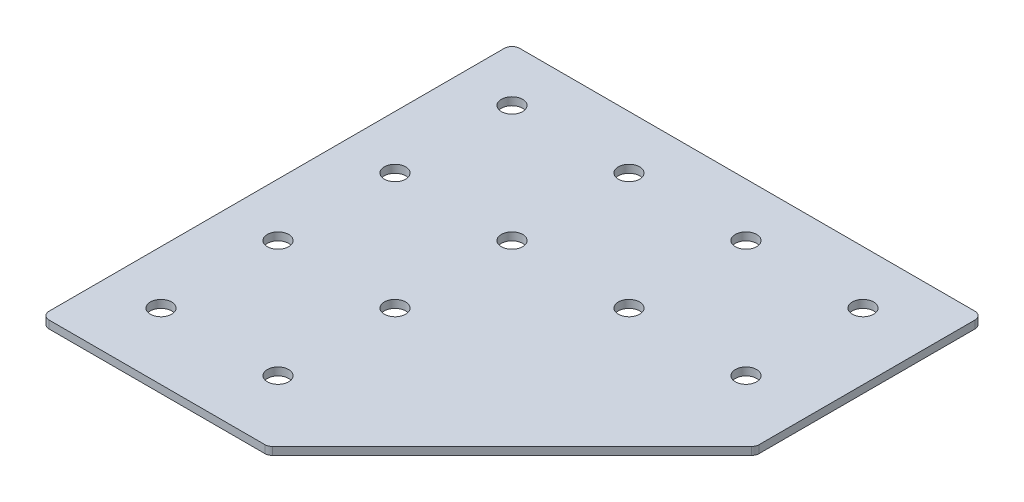
ISO-10303-21;
HEADER;
FILE_DESCRIPTION(('STEP AP214'),'2;1');
FILE_NAME('part.step','',(''),(''),'','','');
FILE_SCHEMA(('AUTOMOTIVE_DESIGN { 1 0 10303 214 1 1 1 1 }'));
ENDSEC;
DATA;
#1=APPLICATION_CONTEXT('core data for automotive mechanical design processes');
#2=APPLICATION_PROTOCOL_DEFINITION('international standard','automotive_design',2000,#1);
#3=PRODUCT_CONTEXT('',#1,'mechanical');
#4=PRODUCT('Part','Part','',(#3));
#5=PRODUCT_RELATED_PRODUCT_CATEGORY('part','',(#4));
#6=PRODUCT_DEFINITION_FORMATION('','',#4);
#7=PRODUCT_DEFINITION_CONTEXT('part definition',#1,'design');
#8=PRODUCT_DEFINITION('design','',#6,#7);
#9=PRODUCT_DEFINITION_SHAPE('','',#8);
#10=(LENGTH_UNIT() NAMED_UNIT(*) SI_UNIT(.MILLI.,.METRE.));
#11=(NAMED_UNIT(*) PLANE_ANGLE_UNIT() SI_UNIT($,.RADIAN.));
#12=(NAMED_UNIT(*) SI_UNIT($,.STERADIAN.) SOLID_ANGLE_UNIT());
#13=UNCERTAINTY_MEASURE_WITH_UNIT(LENGTH_MEASURE(1.E-05),#10,'distance_accuracy_value','');
#14=(GEOMETRIC_REPRESENTATION_CONTEXT(3) GLOBAL_UNCERTAINTY_ASSIGNED_CONTEXT((#13)) GLOBAL_UNIT_ASSIGNED_CONTEXT((#10,
#11,#12)) REPRESENTATION_CONTEXT('',''));
#15=CARTESIAN_POINT('',(0.,0.,0.));
#16=DIRECTION('',(0.,0.,1.));
#17=DIRECTION('',(1.,0.,0.));
#18=AXIS2_PLACEMENT_3D('',#15,#16,#17);
#19=CARTESIAN_POINT('',(-49.3577211963019,1.64126526069458,-48.7830335623448));
#20=DIRECTION('',(0.,-1.,0.));
#21=DIRECTION('',(0.,0.,-1.));
#22=AXIS2_PLACEMENT_3D('',#19,#20,#21);
#23=PLANE('',#22);
#24=CARTESIAN_POINT('',(63.1422788036981,1.64126526069458,-26.2830335623448));
#25=DIRECTION('',(0.,1.,0.));
#26=DIRECTION('',(0.,0.,1.));
#27=AXIS2_PLACEMENT_3D('',#24,#25,#26);
#28=CIRCLE('',#27,4.1);
#29=CARTESIAN_POINT('',(63.1422788036981,1.64126526069458,-22.1830335623448));
#30=VERTEX_POINT('',#29);
#31=EDGE_CURVE('E275',#30,#30,#28,.T.);
#32=ORIENTED_EDGE('',*,*,#31,.T.);
#33=EDGE_LOOP('',(#32));
#34=FACE_BOUND('',#33,.T.);
#35=CARTESIAN_POINT('',(18.1422788036981,1.64126526069458,-26.2830335623448));
#36=DIRECTION('',(0.,1.,0.));
#37=DIRECTION('',(0.,0.,1.));
#38=AXIS2_PLACEMENT_3D('',#35,#36,#37);
#39=CIRCLE('',#38,4.09999999999999);
#40=CARTESIAN_POINT('',(18.1422788036981,1.64126526069458,-22.1830335623448));
#41=VERTEX_POINT('',#40);
#42=EDGE_CURVE('E283',#41,#41,#39,.T.);
#43=ORIENTED_EDGE('',*,*,#42,.T.);
#44=EDGE_LOOP('',(#43));
#45=FACE_BOUND('',#44,.T.);
#46=CARTESIAN_POINT('',(-26.8577211963019,1.64126526069458,63.7169664376552));
#47=DIRECTION('',(0.,1.,0.));
#48=DIRECTION('',(0.,0.,1.));
#49=AXIS2_PLACEMENT_3D('',#46,#47,#48);
#50=CIRCLE('',#49,4.1);
#51=CARTESIAN_POINT('',(-26.8577211963019,1.64126526069458,67.8169664376552));
#52=VERTEX_POINT('',#51);
#53=EDGE_CURVE('E289',#52,#52,#50,.T.);
#54=ORIENTED_EDGE('',*,*,#53,.T.);
#55=EDGE_LOOP('',(#54));
#56=FACE_BOUND('',#55,.T.);
#57=CARTESIAN_POINT('',(-71.8577211963019,1.64126526069458,63.7169664376552));
#58=DIRECTION('',(0.,1.,0.));
#59=DIRECTION('',(0.,0.,1.));
#60=AXIS2_PLACEMENT_3D('',#57,#58,#59);
#61=CIRCLE('',#60,4.1);
#62=CARTESIAN_POINT('',(-71.8577211963019,1.64126526069458,67.8169664376552));
#63=VERTEX_POINT('',#62);
#64=EDGE_CURVE('E295',#63,#63,#61,.T.);
#65=ORIENTED_EDGE('',*,*,#64,.T.);
#66=EDGE_LOOP('',(#65));
#67=FACE_BOUND('',#66,.T.);
#68=CARTESIAN_POINT('',(-26.8577211963019,1.64126526069458,18.7169664376552));
#69=DIRECTION('',(0.,1.,0.));
#70=DIRECTION('',(0.,0.,1.));
#71=AXIS2_PLACEMENT_3D('',#68,#69,#70);
#72=CIRCLE('',#71,4.1);
#73=CARTESIAN_POINT('',(-26.8577211963019,1.64126526069458,22.8169664376552));
#74=VERTEX_POINT('',#73);
#75=EDGE_CURVE('E301',#74,#74,#72,.T.);
#76=ORIENTED_EDGE('',*,*,#75,.T.);
#77=EDGE_LOOP('',(#76));
#78=FACE_BOUND('',#77,.T.);
#79=CARTESIAN_POINT('',(-71.857721196302,1.64126526069458,18.7169664376552));
#80=DIRECTION('',(0.,1.,0.));
#81=DIRECTION('',(0.,0.,1.));
#82=AXIS2_PLACEMENT_3D('',#79,#80,#81);
#83=CIRCLE('',#82,4.1);
#84=CARTESIAN_POINT('',(-71.857721196302,1.64126526069458,22.8169664376552));
#85=VERTEX_POINT('',#84);
#86=EDGE_CURVE('E307',#85,#85,#83,.T.);
#87=ORIENTED_EDGE('',*,*,#86,.T.);
#88=EDGE_LOOP('',(#87));
#89=FACE_BOUND('',#88,.T.);
#90=CARTESIAN_POINT('',(-26.8577211963019,1.64126526069458,-26.2830335623448));
#91=DIRECTION('',(0.,1.,0.));
#92=DIRECTION('',(0.,0.,1.));
#93=AXIS2_PLACEMENT_3D('',#90,#91,#92);
#94=CIRCLE('',#93,4.1);
#95=CARTESIAN_POINT('',(-26.8577211963019,1.64126526069458,-22.1830335623448));
#96=VERTEX_POINT('',#95);
#97=EDGE_CURVE('E313',#96,#96,#94,.T.);
#98=ORIENTED_EDGE('',*,*,#97,.T.);
#99=EDGE_LOOP('',(#98));
#100=FACE_BOUND('',#99,.T.);
#101=CARTESIAN_POINT('',(-71.857721196302,1.64126526069458,-26.2830335623448));
#102=DIRECTION('',(0.,1.,0.));
#103=DIRECTION('',(0.,0.,1.));
#104=AXIS2_PLACEMENT_3D('',#101,#102,#103);
#105=CIRCLE('',#104,4.1);
#106=CARTESIAN_POINT('',(-71.857721196302,1.64126526069458,-22.1830335623448));
#107=VERTEX_POINT('',#106);
#108=EDGE_CURVE('E319',#107,#107,#105,.T.);
#109=ORIENTED_EDGE('',*,*,#108,.T.);
#110=EDGE_LOOP('',(#109));
#111=FACE_BOUND('',#110,.T.);
#112=CARTESIAN_POINT('',(63.1422788036981,1.64126526069458,-71.2830335623448));
#113=DIRECTION('',(0.,1.,0.));
#114=DIRECTION('',(0.,0.,1.));
#115=AXIS2_PLACEMENT_3D('',#112,#113,#114);
#116=CIRCLE('',#115,4.09999999999999);
#117=CARTESIAN_POINT('',(63.1422788036981,1.64126526069458,-67.1830335623448));
#118=VERTEX_POINT('',#117);
#119=EDGE_CURVE('E325',#118,#118,#116,.T.);
#120=ORIENTED_EDGE('',*,*,#119,.T.);
#121=EDGE_LOOP('',(#120));
#122=FACE_BOUND('',#121,.T.);
#123=CARTESIAN_POINT('',(18.1422788036981,1.64126526069458,-71.2830335623448));
#124=DIRECTION('',(0.,1.,0.));
#125=DIRECTION('',(0.,0.,1.));
#126=AXIS2_PLACEMENT_3D('',#123,#124,#125);
#127=CIRCLE('',#126,4.09999999999999);
#128=CARTESIAN_POINT('',(18.1422788036981,1.64126526069458,-67.1830335623448));
#129=VERTEX_POINT('',#128);
#130=EDGE_CURVE('E331',#129,#129,#127,.T.);
#131=ORIENTED_EDGE('',*,*,#130,.T.);
#132=EDGE_LOOP('',(#131));
#133=FACE_BOUND('',#132,.T.);
#134=CARTESIAN_POINT('',(-26.8577211963019,1.64126526069458,-71.2830335623448));
#135=DIRECTION('',(0.,1.,0.));
#136=DIRECTION('',(0.,0.,1.));
#137=AXIS2_PLACEMENT_3D('',#134,#135,#136);
#138=CIRCLE('',#137,4.1);
#139=CARTESIAN_POINT('',(-26.8577211963019,1.64126526069458,-67.1830335623448));
#140=VERTEX_POINT('',#139);
#141=EDGE_CURVE('E337',#140,#140,#138,.T.);
#142=ORIENTED_EDGE('',*,*,#141,.T.);
#143=EDGE_LOOP('',(#142));
#144=FACE_BOUND('',#143,.T.);
#145=CARTESIAN_POINT('',(-71.857721196302,1.64126526069458,-71.2830335623448));
#146=DIRECTION('',(0.,1.,0.));
#147=DIRECTION('',(0.,0.,1.));
#148=AXIS2_PLACEMENT_3D('',#145,#146,#147);
#149=CIRCLE('',#148,4.1);
#150=CARTESIAN_POINT('',(-71.857721196302,1.64126526069458,-67.1830335623448));
#151=VERTEX_POINT('',#150);
#152=EDGE_CURVE('E175',#151,#151,#149,.T.);
#153=ORIENTED_EDGE('',*,*,#152,.T.);
#154=EDGE_LOOP('',(#153));
#155=FACE_BOUND('',#154,.T.);
#156=DIRECTION('',(1.,0.,0.));
#157=VECTOR('',#156,1.);
#158=CARTESIAN_POINT('',(-92.357721196302,1.64126526069458,89.2169664376552));
#159=LINE('',#158,#157);
#160=CARTESIAN_POINT('',(-89.357721196302,1.64126526069458,89.2169664376552));
#161=VERTEX_POINT('',#160);
#162=CARTESIAN_POINT('',(-6.42878900816728,1.64126526069458,89.2169664376552));
#163=VERTEX_POINT('',#162);
#164=EDGE_CURVE('E121',#161,#163,#159,.T.);
#165=ORIENTED_EDGE('',*,*,#164,.F.);
#166=CARTESIAN_POINT('',(-89.357721196302,1.64126526069458,86.2169664376552));
#167=DIRECTION('',(0.,-1.,0.));
#168=DIRECTION('',(0.,0.,-1.));
#169=AXIS2_PLACEMENT_3D('',#166,#167,#168);
#170=CIRCLE('',#169,3.);
#171=CARTESIAN_POINT('',(-92.357721196302,1.64126526069458,86.2169664376552));
#172=VERTEX_POINT('',#171);
#173=EDGE_CURVE('E145',#161,#172,#170,.T.);
#174=ORIENTED_EDGE('',*,*,#173,.T.);
#175=DIRECTION('',(0.,0.,1.));
#176=VECTOR('',#175,1.);
#177=CARTESIAN_POINT('',(-92.357721196302,1.64126526069458,-91.7830335623448));
#178=LINE('',#177,#176);
#179=CARTESIAN_POINT('',(-92.357721196302,1.64126526069458,-88.7830335623448));
#180=VERTEX_POINT('',#179);
#181=EDGE_CURVE('E162',#180,#172,#178,.T.);
#182=ORIENTED_EDGE('',*,*,#181,.F.);
#183=CARTESIAN_POINT('',(-89.357721196302,1.64126526069458,-88.7830335623448));
#184=DIRECTION('',(0.,-1.,0.));
#185=DIRECTION('',(0.,0.,-1.));
#186=AXIS2_PLACEMENT_3D('',#183,#184,#185);
#187=CIRCLE('',#186,3.);
#188=CARTESIAN_POINT('',(-89.357721196302,1.64126526069458,-91.7830335623448));
#189=VERTEX_POINT('',#188);
#190=EDGE_CURVE('E117',#180,#189,#187,.T.);
#191=ORIENTED_EDGE('',*,*,#190,.T.);
#192=DIRECTION('',(-1.,0.,0.));
#193=VECTOR('',#192,1.);
#194=CARTESIAN_POINT('',(88.642278803698,1.64126526069458,-91.7830335623448));
#195=LINE('',#194,#193);
#196=CARTESIAN_POINT('',(85.642278803698,1.64126526069458,-91.7830335623448));
#197=VERTEX_POINT('',#196);
#198=EDGE_CURVE('E160',#197,#189,#195,.T.);
#199=ORIENTED_EDGE('',*,*,#198,.F.);
#200=CARTESIAN_POINT('',(85.642278803698,1.64126526069458,-88.7830335623448));
#201=DIRECTION('',(0.,-1.,0.));
#202=DIRECTION('',(0.,0.,-1.));
#203=AXIS2_PLACEMENT_3D('',#200,#201,#202);
#204=CIRCLE('',#203,3.);
#205=CARTESIAN_POINT('',(88.642278803698,1.64126526069458,-88.7830335623448));
#206=VERTEX_POINT('',#205);
#207=EDGE_CURVE('E140',#197,#206,#204,.T.);
#208=ORIENTED_EDGE('',*,*,#207,.T.);
#209=DIRECTION('',(0.,0.,-1.));
#210=VECTOR('',#209,1.);
#211=CARTESIAN_POINT('',(88.642278803698,1.64126526069458,-4.6114606870909));
#212=LINE('',#211,#210);
#213=CARTESIAN_POINT('',(88.642278803698,1.64126526069458,-5.85410137421019));
#214=VERTEX_POINT('',#213);
#215=EDGE_CURVE('E163',#214,#206,#212,.T.);
#216=ORIENTED_EDGE('',*,*,#215,.F.);
#217=CARTESIAN_POINT('',(85.642278803698,1.64126526069458,-5.85410137421019));
#218=DIRECTION('',(0.,-1.,0.));
#219=DIRECTION('',(0.,0.,-1.));
#220=AXIS2_PLACEMENT_3D('',#217,#218,#219);
#221=CIRCLE('',#220,3.);
#222=CARTESIAN_POINT('',(87.7635991472576,1.64126526069458,-3.73278103065054));
#223=VERTEX_POINT('',#222);
#224=EDGE_CURVE('E31',#214,#223,#221,.T.);
#225=ORIENTED_EDGE('',*,*,#224,.T.);
#226=DIRECTION('',(0.707106781186547,0.,-0.707106781186548));
#227=VECTOR('',#226,1.);
#228=CARTESIAN_POINT('',(-5.18614832104801,1.64126526069458,89.2169664376552));
#229=LINE('',#228,#227);
#230=CARTESIAN_POINT('',(-4.30746866460764,1.64126526069458,88.3382867812148));
#231=VERTEX_POINT('',#230);
#232=EDGE_CURVE('E118',#231,#223,#229,.T.);
#233=ORIENTED_EDGE('',*,*,#232,.F.);
#234=CARTESIAN_POINT('',(-6.42878900816728,1.64126526069458,86.2169664376552));
#235=DIRECTION('',(0.,-1.,0.));
#236=DIRECTION('',(0.,0.,-1.));
#237=AXIS2_PLACEMENT_3D('',#234,#235,#236);
#238=CIRCLE('',#237,3.);
#239=EDGE_CURVE('E143',#231,#163,#238,.T.);
#240=ORIENTED_EDGE('',*,*,#239,.T.);
#241=EDGE_LOOP('',(#165,#174,#182,#191,#199,#208,#216,#225,#233,#240));
#242=FACE_BOUND('',#241,.T.);
#243=ADVANCED_FACE('F16',(#34,#45,#56,#67,#78,#89,#100,#111,#122,#133,#144,#155,#242),#23,.T.);
#244=CARTESIAN_POINT('',(88.642278803698,1.64126526069458,-4.6114606870909));
#245=DIRECTION('',(1.,0.,0.));
#246=DIRECTION('',(0.,0.,-1.));
#247=AXIS2_PLACEMENT_3D('',#244,#245,#246);
#248=PLANE('',#247);
#249=DIRECTION('',(0.,0.,-1.));
#250=VECTOR('',#249,1.);
#251=CARTESIAN_POINT('',(88.642278803698,4.64126526069458,-4.6114606870909));
#252=LINE('',#251,#250);
#253=CARTESIAN_POINT('',(88.642278803698,4.64126526069458,-5.85410137421019));
#254=VERTEX_POINT('',#253);
#255=CARTESIAN_POINT('',(88.642278803698,4.64126526069458,-88.7830335623448));
#256=VERTEX_POINT('',#255);
#257=EDGE_CURVE('E172',#254,#256,#252,.T.);
#258=ORIENTED_EDGE('',*,*,#257,.F.);
#259=DIRECTION('',(0.,1.,0.));
#260=VECTOR('',#259,1.);
#261=CARTESIAN_POINT('',(88.642278803698,1.64126526069458,-5.85410137421019));
#262=LINE('',#261,#260);
#263=EDGE_CURVE('E154',#254,#214,#262,.F.);
#264=ORIENTED_EDGE('',*,*,#263,.T.);
#265=ORIENTED_EDGE('',*,*,#215,.T.);
#266=DIRECTION('',(0.,1.,0.));
#267=VECTOR('',#266,1.);
#268=CARTESIAN_POINT('',(88.642278803698,1.64126526069458,-88.7830335623448));
#269=LINE('',#268,#267);
#270=EDGE_CURVE('E151',#206,#256,#269,.T.);
#271=ORIENTED_EDGE('',*,*,#270,.T.);
#272=EDGE_LOOP('',(#258,#264,#265,#271));
#273=FACE_BOUND('',#272,.T.);
#274=ADVANCED_FACE('F206',(#273),#248,.T.);
#275=CARTESIAN_POINT('',(-5.18614832104801,1.64126526069458,89.2169664376552));
#276=DIRECTION('',(0.707106781186548,0.,0.707106781186547));
#277=DIRECTION('',(0.707106781186547,0.,-0.707106781186548));
#278=AXIS2_PLACEMENT_3D('',#275,#276,#277);
#279=PLANE('',#278);
#280=DIRECTION('',(0.707106781186547,0.,-0.707106781186548));
#281=VECTOR('',#280,1.);
#282=CARTESIAN_POINT('',(-5.18614832104801,4.64126526069458,89.2169664376552));
#283=LINE('',#282,#281);
#284=CARTESIAN_POINT('',(-4.30746866460764,4.64126526069458,88.3382867812148));
#285=VERTEX_POINT('',#284);
#286=CARTESIAN_POINT('',(87.7635991472576,4.64126526069458,-3.73278103065054));
#287=VERTEX_POINT('',#286);
#288=EDGE_CURVE('E124',#285,#287,#283,.T.);
#289=ORIENTED_EDGE('',*,*,#288,.F.);
#290=DIRECTION('',(0.,1.,0.));
#291=VECTOR('',#290,1.);
#292=CARTESIAN_POINT('',(-4.30746866460764,1.64126526069458,88.3382867812148));
#293=LINE('',#292,#291);
#294=EDGE_CURVE('E38',#285,#231,#293,.F.);
#295=ORIENTED_EDGE('',*,*,#294,.T.);
#296=ORIENTED_EDGE('',*,*,#232,.T.);
#297=DIRECTION('',(0.,1.,0.));
#298=VECTOR('',#297,1.);
#299=CARTESIAN_POINT('',(87.7635991472576,1.64126526069458,-3.73278103065056));
#300=LINE('',#299,#298);
#301=EDGE_CURVE('E147',#223,#287,#300,.T.);
#302=ORIENTED_EDGE('',*,*,#301,.T.);
#303=EDGE_LOOP('',(#289,#295,#296,#302));
#304=FACE_BOUND('',#303,.T.);
#305=ADVANCED_FACE('F180',(#304),#279,.T.);
#306=CARTESIAN_POINT('',(-92.357721196302,1.64126526069458,89.2169664376552));
#307=DIRECTION('',(0.,0.,1.));
#308=DIRECTION('',(1.,0.,0.));
#309=AXIS2_PLACEMENT_3D('',#306,#307,#308);
#310=PLANE('',#309);
#311=DIRECTION('',(1.,0.,0.));
#312=VECTOR('',#311,1.);
#313=CARTESIAN_POINT('',(-92.357721196302,4.64126526069458,89.2169664376552));
#314=LINE('',#313,#312);
#315=CARTESIAN_POINT('',(-89.357721196302,4.64126526069458,89.2169664376552));
#316=VERTEX_POINT('',#315);
#317=CARTESIAN_POINT('',(-6.42878900816728,4.64126526069458,89.2169664376552));
#318=VERTEX_POINT('',#317);
#319=EDGE_CURVE('E114',#316,#318,#314,.T.);
#320=ORIENTED_EDGE('',*,*,#319,.F.);
#321=DIRECTION('',(0.,1.,0.));
#322=VECTOR('',#321,1.);
#323=CARTESIAN_POINT('',(-89.357721196302,1.64126526069458,89.2169664376552));
#324=LINE('',#323,#322);
#325=EDGE_CURVE('E137',#316,#161,#324,.F.);
#326=ORIENTED_EDGE('',*,*,#325,.T.);
#327=ORIENTED_EDGE('',*,*,#164,.T.);
#328=DIRECTION('',(0.,1.,0.));
#329=VECTOR('',#328,1.);
#330=CARTESIAN_POINT('',(-6.42878900816728,1.64126526069458,89.2169664376552));
#331=LINE('',#330,#329);
#332=EDGE_CURVE('E134',#163,#318,#331,.T.);
#333=ORIENTED_EDGE('',*,*,#332,.T.);
#334=EDGE_LOOP('',(#320,#326,#327,#333));
#335=FACE_BOUND('',#334,.T.);
#336=ADVANCED_FACE('F189',(#335),#310,.T.);
#337=CARTESIAN_POINT('',(-92.357721196302,1.64126526069458,-91.7830335623448));
#338=DIRECTION('',(-1.,0.,0.));
#339=DIRECTION('',(0.,0.,1.));
#340=AXIS2_PLACEMENT_3D('',#337,#338,#339);
#341=PLANE('',#340);
#342=ORIENTED_EDGE('',*,*,#181,.T.);
#343=DIRECTION('',(0.,1.,0.));
#344=VECTOR('',#343,1.);
#345=CARTESIAN_POINT('',(-92.357721196302,1.64126526069458,86.2169664376552));
#346=LINE('',#345,#344);
#347=CARTESIAN_POINT('',(-92.357721196302,4.64126526069458,86.2169664376552));
#348=VERTEX_POINT('',#347);
#349=EDGE_CURVE('E105',#172,#348,#346,.T.);
#350=ORIENTED_EDGE('',*,*,#349,.T.);
#351=DIRECTION('',(0.,0.,1.));
#352=VECTOR('',#351,1.);
#353=CARTESIAN_POINT('',(-92.357721196302,4.64126526069458,-91.7830335623448));
#354=LINE('',#353,#352);
#355=CARTESIAN_POINT('',(-92.357721196302,4.64126526069458,-88.7830335623448));
#356=VERTEX_POINT('',#355);
#357=EDGE_CURVE('E97',#356,#348,#354,.T.);
#358=ORIENTED_EDGE('',*,*,#357,.F.);
#359=DIRECTION('',(0.,1.,0.));
#360=VECTOR('',#359,1.);
#361=CARTESIAN_POINT('',(-92.357721196302,1.64126526069458,-88.7830335623448));
#362=LINE('',#361,#360);
#363=EDGE_CURVE('E111',#356,#180,#362,.F.);
#364=ORIENTED_EDGE('',*,*,#363,.T.);
#365=EDGE_LOOP('',(#342,#350,#358,#364));
#366=FACE_BOUND('',#365,.T.);
#367=ADVANCED_FACE('F110',(#366),#341,.T.);
#368=CARTESIAN_POINT('',(88.642278803698,1.64126526069458,-91.7830335623448));
#369=DIRECTION('',(0.,0.,-1.));
#370=DIRECTION('',(-1.,0.,0.));
#371=AXIS2_PLACEMENT_3D('',#368,#369,#370);
#372=PLANE('',#371);
#373=DIRECTION('',(-1.,0.,0.));
#374=VECTOR('',#373,1.);
#375=CARTESIAN_POINT('',(88.642278803698,4.64126526069458,-91.7830335623448));
#376=LINE('',#375,#374);
#377=CARTESIAN_POINT('',(85.642278803698,4.64126526069458,-91.7830335623448));
#378=VERTEX_POINT('',#377);
#379=CARTESIAN_POINT('',(-89.357721196302,4.64126526069458,-91.7830335623448));
#380=VERTEX_POINT('',#379);
#381=EDGE_CURVE('E99',#378,#380,#376,.T.);
#382=ORIENTED_EDGE('',*,*,#381,.F.);
#383=DIRECTION('',(0.,1.,0.));
#384=VECTOR('',#383,1.);
#385=CARTESIAN_POINT('',(85.642278803698,1.64126526069458,-91.7830335623448));
#386=LINE('',#385,#384);
#387=EDGE_CURVE('E10',#378,#197,#386,.F.);
#388=ORIENTED_EDGE('',*,*,#387,.T.);
#389=ORIENTED_EDGE('',*,*,#198,.T.);
#390=DIRECTION('',(0.,1.,0.));
#391=VECTOR('',#390,1.);
#392=CARTESIAN_POINT('',(-89.357721196302,1.64126526069458,-91.7830335623448));
#393=LINE('',#392,#391);
#394=EDGE_CURVE('E24',#189,#380,#393,.T.);
#395=ORIENTED_EDGE('',*,*,#394,.T.);
#396=EDGE_LOOP('',(#382,#388,#389,#395));
#397=FACE_BOUND('',#396,.T.);
#398=ADVANCED_FACE('F157',(#397),#372,.T.);
#399=CARTESIAN_POINT('',(-49.3577211963019,4.64126526069458,-48.7830335623448));
#400=DIRECTION('',(0.,-1.,0.));
#401=DIRECTION('',(0.,0.,-1.));
#402=AXIS2_PLACEMENT_3D('',#399,#400,#401);
#403=PLANE('',#402);
#404=CARTESIAN_POINT('',(63.1422788036981,4.64126526069458,-26.2830335623448));
#405=DIRECTION('',(0.,1.,0.));
#406=DIRECTION('',(0.,0.,1.));
#407=AXIS2_PLACEMENT_3D('',#404,#405,#406);
#408=CIRCLE('',#407,4.1);
#409=CARTESIAN_POINT('',(63.1422788036981,4.64126526069458,-22.1830335623448));
#410=VERTEX_POINT('',#409);
#411=EDGE_CURVE('E278',#410,#410,#408,.T.);
#412=ORIENTED_EDGE('',*,*,#411,.F.);
#413=EDGE_LOOP('',(#412));
#414=FACE_BOUND('',#413,.T.);
#415=CARTESIAN_POINT('',(18.1422788036981,4.64126526069458,-26.2830335623448));
#416=DIRECTION('',(0.,1.,0.));
#417=DIRECTION('',(0.,0.,1.));
#418=AXIS2_PLACEMENT_3D('',#415,#416,#417);
#419=CIRCLE('',#418,4.09999999999999);
#420=CARTESIAN_POINT('',(18.1422788036981,4.64126526069458,-22.1830335623448));
#421=VERTEX_POINT('',#420);
#422=EDGE_CURVE('E280',#421,#421,#419,.T.);
#423=ORIENTED_EDGE('',*,*,#422,.F.);
#424=EDGE_LOOP('',(#423));
#425=FACE_BOUND('',#424,.T.);
#426=CARTESIAN_POINT('',(-26.8577211963019,4.64126526069458,63.7169664376552));
#427=DIRECTION('',(0.,1.,0.));
#428=DIRECTION('',(0.,0.,1.));
#429=AXIS2_PLACEMENT_3D('',#426,#427,#428);
#430=CIRCLE('',#429,4.1);
#431=CARTESIAN_POINT('',(-26.8577211963019,4.64126526069458,67.8169664376552));
#432=VERTEX_POINT('',#431);
#433=EDGE_CURVE('E286',#432,#432,#430,.T.);
#434=ORIENTED_EDGE('',*,*,#433,.F.);
#435=EDGE_LOOP('',(#434));
#436=FACE_BOUND('',#435,.T.);
#437=CARTESIAN_POINT('',(-71.8577211963019,4.64126526069458,63.7169664376552));
#438=DIRECTION('',(0.,1.,0.));
#439=DIRECTION('',(0.,0.,1.));
#440=AXIS2_PLACEMENT_3D('',#437,#438,#439);
#441=CIRCLE('',#440,4.1);
#442=CARTESIAN_POINT('',(-71.8577211963019,4.64126526069458,67.8169664376552));
#443=VERTEX_POINT('',#442);
#444=EDGE_CURVE('E292',#443,#443,#441,.T.);
#445=ORIENTED_EDGE('',*,*,#444,.F.);
#446=EDGE_LOOP('',(#445));
#447=FACE_BOUND('',#446,.T.);
#448=CARTESIAN_POINT('',(-26.8577211963019,4.64126526069458,18.7169664376552));
#449=DIRECTION('',(0.,1.,0.));
#450=DIRECTION('',(0.,0.,1.));
#451=AXIS2_PLACEMENT_3D('',#448,#449,#450);
#452=CIRCLE('',#451,4.1);
#453=CARTESIAN_POINT('',(-26.8577211963019,4.64126526069458,22.8169664376552));
#454=VERTEX_POINT('',#453);
#455=EDGE_CURVE('E298',#454,#454,#452,.T.);
#456=ORIENTED_EDGE('',*,*,#455,.F.);
#457=EDGE_LOOP('',(#456));
#458=FACE_BOUND('',#457,.T.);
#459=CARTESIAN_POINT('',(-71.857721196302,4.64126526069458,18.7169664376552));
#460=DIRECTION('',(0.,1.,0.));
#461=DIRECTION('',(0.,0.,1.));
#462=AXIS2_PLACEMENT_3D('',#459,#460,#461);
#463=CIRCLE('',#462,4.1);
#464=CARTESIAN_POINT('',(-71.857721196302,4.64126526069458,22.8169664376552));
#465=VERTEX_POINT('',#464);
#466=EDGE_CURVE('E304',#465,#465,#463,.T.);
#467=ORIENTED_EDGE('',*,*,#466,.F.);
#468=EDGE_LOOP('',(#467));
#469=FACE_BOUND('',#468,.T.);
#470=CARTESIAN_POINT('',(-26.8577211963019,4.64126526069458,-26.2830335623448));
#471=DIRECTION('',(0.,1.,0.));
#472=DIRECTION('',(0.,0.,1.));
#473=AXIS2_PLACEMENT_3D('',#470,#471,#472);
#474=CIRCLE('',#473,4.1);
#475=CARTESIAN_POINT('',(-26.8577211963019,4.64126526069458,-22.1830335623448));
#476=VERTEX_POINT('',#475);
#477=EDGE_CURVE('E310',#476,#476,#474,.T.);
#478=ORIENTED_EDGE('',*,*,#477,.F.);
#479=EDGE_LOOP('',(#478));
#480=FACE_BOUND('',#479,.T.);
#481=CARTESIAN_POINT('',(-71.857721196302,4.64126526069458,-26.2830335623448));
#482=DIRECTION('',(0.,1.,0.));
#483=DIRECTION('',(0.,0.,1.));
#484=AXIS2_PLACEMENT_3D('',#481,#482,#483);
#485=CIRCLE('',#484,4.1);
#486=CARTESIAN_POINT('',(-71.857721196302,4.64126526069458,-22.1830335623448));
#487=VERTEX_POINT('',#486);
#488=EDGE_CURVE('E316',#487,#487,#485,.T.);
#489=ORIENTED_EDGE('',*,*,#488,.F.);
#490=EDGE_LOOP('',(#489));
#491=FACE_BOUND('',#490,.T.);
#492=CARTESIAN_POINT('',(63.1422788036981,4.64126526069458,-71.2830335623448));
#493=DIRECTION('',(0.,1.,0.));
#494=DIRECTION('',(0.,0.,1.));
#495=AXIS2_PLACEMENT_3D('',#492,#493,#494);
#496=CIRCLE('',#495,4.09999999999999);
#497=CARTESIAN_POINT('',(63.1422788036981,4.64126526069458,-67.1830335623448));
#498=VERTEX_POINT('',#497);
#499=EDGE_CURVE('E322',#498,#498,#496,.T.);
#500=ORIENTED_EDGE('',*,*,#499,.F.);
#501=EDGE_LOOP('',(#500));
#502=FACE_BOUND('',#501,.T.);
#503=CARTESIAN_POINT('',(18.1422788036981,4.64126526069458,-71.2830335623448));
#504=DIRECTION('',(0.,1.,0.));
#505=DIRECTION('',(0.,0.,1.));
#506=AXIS2_PLACEMENT_3D('',#503,#504,#505);
#507=CIRCLE('',#506,4.09999999999999);
#508=CARTESIAN_POINT('',(18.1422788036981,4.64126526069458,-67.1830335623448));
#509=VERTEX_POINT('',#508);
#510=EDGE_CURVE('E328',#509,#509,#507,.T.);
#511=ORIENTED_EDGE('',*,*,#510,.F.);
#512=EDGE_LOOP('',(#511));
#513=FACE_BOUND('',#512,.T.);
#514=CARTESIAN_POINT('',(-26.8577211963019,4.64126526069458,-71.2830335623448));
#515=DIRECTION('',(0.,1.,0.));
#516=DIRECTION('',(0.,0.,1.));
#517=AXIS2_PLACEMENT_3D('',#514,#515,#516);
#518=CIRCLE('',#517,4.1);
#519=CARTESIAN_POINT('',(-26.8577211963019,4.64126526069458,-67.1830335623448));
#520=VERTEX_POINT('',#519);
#521=EDGE_CURVE('E334',#520,#520,#518,.T.);
#522=ORIENTED_EDGE('',*,*,#521,.F.);
#523=EDGE_LOOP('',(#522));
#524=FACE_BOUND('',#523,.T.);
#525=CARTESIAN_POINT('',(-71.857721196302,4.64126526069458,-71.2830335623448));
#526=DIRECTION('',(0.,1.,0.));
#527=DIRECTION('',(0.,0.,1.));
#528=AXIS2_PLACEMENT_3D('',#525,#526,#527);
#529=CIRCLE('',#528,4.1);
#530=CARTESIAN_POINT('',(-71.857721196302,4.64126526069458,-67.1830335623448));
#531=VERTEX_POINT('',#530);
#532=EDGE_CURVE('E340',#531,#531,#529,.T.);
#533=ORIENTED_EDGE('',*,*,#532,.F.);
#534=EDGE_LOOP('',(#533));
#535=FACE_BOUND('',#534,.T.);
#536=ORIENTED_EDGE('',*,*,#357,.T.);
#537=CARTESIAN_POINT('',(-89.357721196302,4.64126526069458,86.2169664376552));
#538=DIRECTION('',(0.,-1.,0.));
#539=DIRECTION('',(0.,0.,-1.));
#540=AXIS2_PLACEMENT_3D('',#537,#538,#539);
#541=CIRCLE('',#540,3.);
#542=EDGE_CURVE('E132',#348,#316,#541,.F.);
#543=ORIENTED_EDGE('',*,*,#542,.T.);
#544=ORIENTED_EDGE('',*,*,#319,.T.);
#545=CARTESIAN_POINT('',(-6.42878900816728,4.64126526069458,86.2169664376552));
#546=DIRECTION('',(0.,-1.,0.));
#547=DIRECTION('',(0.,0.,-1.));
#548=AXIS2_PLACEMENT_3D('',#545,#546,#547);
#549=CIRCLE('',#548,3.);
#550=EDGE_CURVE('E130',#318,#285,#549,.F.);
#551=ORIENTED_EDGE('',*,*,#550,.T.);
#552=ORIENTED_EDGE('',*,*,#288,.T.);
#553=CARTESIAN_POINT('',(85.642278803698,4.64126526069458,-5.85410137421019));
#554=DIRECTION('',(0.,-1.,0.));
#555=DIRECTION('',(0.,0.,-1.));
#556=AXIS2_PLACEMENT_3D('',#553,#554,#555);
#557=CIRCLE('',#556,3.);
#558=EDGE_CURVE('E128',#287,#254,#557,.F.);
#559=ORIENTED_EDGE('',*,*,#558,.T.);
#560=ORIENTED_EDGE('',*,*,#257,.T.);
#561=CARTESIAN_POINT('',(85.642278803698,4.64126526069458,-88.7830335623448));
#562=DIRECTION('',(0.,-1.,0.));
#563=DIRECTION('',(0.,0.,-1.));
#564=AXIS2_PLACEMENT_3D('',#561,#562,#563);
#565=CIRCLE('',#564,3.);
#566=EDGE_CURVE('E104',#256,#378,#565,.F.);
#567=ORIENTED_EDGE('',*,*,#566,.T.);
#568=ORIENTED_EDGE('',*,*,#381,.T.);
#569=CARTESIAN_POINT('',(-89.357721196302,4.64126526069458,-88.7830335623448));
#570=DIRECTION('',(0.,-1.,0.));
#571=DIRECTION('',(0.,0.,-1.));
#572=AXIS2_PLACEMENT_3D('',#569,#570,#571);
#573=CIRCLE('',#572,3.);
#574=EDGE_CURVE('E94',#380,#356,#573,.F.);
#575=ORIENTED_EDGE('',*,*,#574,.T.);
#576=EDGE_LOOP('',(#536,#543,#544,#551,#552,#559,#560,#567,#568,#575));
#577=FACE_BOUND('',#576,.T.);
#578=ADVANCED_FACE('F96',(#414,#425,#436,#447,#458,#469,#480,#491,#502,#513,#524,#535,#577),
#403,.F.);
#579=CARTESIAN_POINT('',(-89.357721196302,1.64126526069458,86.2169664376552));
#580=DIRECTION('',(0.,1.,0.));
#581=DIRECTION('',(0.,0.,1.));
#582=AXIS2_PLACEMENT_3D('',#579,#580,#581);
#583=CYLINDRICAL_SURFACE('',#582,3.);
#584=ORIENTED_EDGE('',*,*,#173,.F.);
#585=ORIENTED_EDGE('',*,*,#325,.F.);
#586=ORIENTED_EDGE('',*,*,#542,.F.);
#587=ORIENTED_EDGE('',*,*,#349,.F.);
#588=EDGE_LOOP('',(#584,#585,#586,#587));
#589=FACE_BOUND('',#588,.T.);
#590=ADVANCED_FACE('F192',(#589),#583,.T.);
#591=CARTESIAN_POINT('',(-6.42878900816728,1.64126526069458,86.2169664376552));
#592=DIRECTION('',(0.,1.,0.));
#593=DIRECTION('',(0.,0.,1.));
#594=AXIS2_PLACEMENT_3D('',#591,#592,#593);
#595=CYLINDRICAL_SURFACE('',#594,3.);
#596=ORIENTED_EDGE('',*,*,#239,.F.);
#597=ORIENTED_EDGE('',*,*,#294,.F.);
#598=ORIENTED_EDGE('',*,*,#550,.F.);
#599=ORIENTED_EDGE('',*,*,#332,.F.);
#600=EDGE_LOOP('',(#596,#597,#598,#599));
#601=FACE_BOUND('',#600,.T.);
#602=ADVANCED_FACE('F184',(#601),#595,.T.);
#603=CARTESIAN_POINT('',(85.642278803698,1.64126526069458,-5.85410137421019));
#604=DIRECTION('',(0.,1.,0.));
#605=DIRECTION('',(0.,0.,1.));
#606=AXIS2_PLACEMENT_3D('',#603,#604,#605);
#607=CYLINDRICAL_SURFACE('',#606,3.);
#608=ORIENTED_EDGE('',*,*,#224,.F.);
#609=ORIENTED_EDGE('',*,*,#263,.F.);
#610=ORIENTED_EDGE('',*,*,#558,.F.);
#611=ORIENTED_EDGE('',*,*,#301,.F.);
#612=EDGE_LOOP('',(#608,#609,#610,#611));
#613=FACE_BOUND('',#612,.T.);
#614=ADVANCED_FACE('F200',(#613),#607,.T.);
#615=CARTESIAN_POINT('',(85.642278803698,1.64126526069458,-88.7830335623448));
#616=DIRECTION('',(0.,1.,0.));
#617=DIRECTION('',(0.,0.,1.));
#618=AXIS2_PLACEMENT_3D('',#615,#616,#617);
#619=CYLINDRICAL_SURFACE('',#618,3.);
#620=ORIENTED_EDGE('',*,*,#207,.F.);
#621=ORIENTED_EDGE('',*,*,#387,.F.);
#622=ORIENTED_EDGE('',*,*,#566,.F.);
#623=ORIENTED_EDGE('',*,*,#270,.F.);
#624=EDGE_LOOP('',(#620,#621,#622,#623));
#625=FACE_BOUND('',#624,.T.);
#626=ADVANCED_FACE('F451',(#625),#619,.T.);
#627=CARTESIAN_POINT('',(-89.357721196302,1.64126526069458,-88.7830335623448));
#628=DIRECTION('',(0.,1.,0.));
#629=DIRECTION('',(0.,0.,1.));
#630=AXIS2_PLACEMENT_3D('',#627,#628,#629);
#631=CYLINDRICAL_SURFACE('',#630,3.);
#632=ORIENTED_EDGE('',*,*,#190,.F.);
#633=ORIENTED_EDGE('',*,*,#363,.F.);
#634=ORIENTED_EDGE('',*,*,#574,.F.);
#635=ORIENTED_EDGE('',*,*,#394,.F.);
#636=EDGE_LOOP('',(#632,#633,#634,#635));
#637=FACE_BOUND('',#636,.T.);
#638=ADVANCED_FACE('F18',(#637),#631,.T.);
#639=CARTESIAN_POINT('',(-71.857721196302,1.64126526069458,-71.2830335623448));
#640=DIRECTION('',(0.,1.,0.));
#641=DIRECTION('',(0.,0.,1.));
#642=AXIS2_PLACEMENT_3D('',#639,#640,#641);
#643=CYLINDRICAL_SURFACE('',#642,4.1);
#644=ORIENTED_EDGE('',*,*,#152,.F.);
#645=EDGE_LOOP('',(#644));
#646=FACE_BOUND('',#645,.T.);
#647=ORIENTED_EDGE('',*,*,#532,.T.);
#648=EDGE_LOOP('',(#647));
#649=FACE_BOUND('',#648,.T.);
#650=ADVANCED_FACE('F224',(#646,#649),#643,.F.);
#651=CARTESIAN_POINT('',(-26.8577211963019,1.64126526069458,-71.2830335623448));
#652=DIRECTION('',(0.,1.,0.));
#653=DIRECTION('',(0.,0.,1.));
#654=AXIS2_PLACEMENT_3D('',#651,#652,#653);
#655=CYLINDRICAL_SURFACE('',#654,4.1);
#656=ORIENTED_EDGE('',*,*,#141,.F.);
#657=EDGE_LOOP('',(#656));
#658=FACE_BOUND('',#657,.T.);
#659=ORIENTED_EDGE('',*,*,#521,.T.);
#660=EDGE_LOOP('',(#659));
#661=FACE_BOUND('',#660,.T.);
#662=ADVANCED_FACE('F227',(#658,#661),#655,.F.);
#663=CARTESIAN_POINT('',(18.1422788036981,1.64126526069458,-71.2830335623448));
#664=DIRECTION('',(0.,1.,0.));
#665=DIRECTION('',(0.,0.,1.));
#666=AXIS2_PLACEMENT_3D('',#663,#664,#665);
#667=CYLINDRICAL_SURFACE('',#666,4.09999999999999);
#668=ORIENTED_EDGE('',*,*,#130,.F.);
#669=EDGE_LOOP('',(#668));
#670=FACE_BOUND('',#669,.T.);
#671=ORIENTED_EDGE('',*,*,#510,.T.);
#672=EDGE_LOOP('',(#671));
#673=FACE_BOUND('',#672,.T.);
#674=ADVANCED_FACE('F231',(#670,#673),#667,.F.);
#675=CARTESIAN_POINT('',(63.1422788036981,1.64126526069458,-71.2830335623448));
#676=DIRECTION('',(0.,1.,0.));
#677=DIRECTION('',(0.,0.,1.));
#678=AXIS2_PLACEMENT_3D('',#675,#676,#677);
#679=CYLINDRICAL_SURFACE('',#678,4.09999999999999);
#680=ORIENTED_EDGE('',*,*,#119,.F.);
#681=EDGE_LOOP('',(#680));
#682=FACE_BOUND('',#681,.T.);
#683=ORIENTED_EDGE('',*,*,#499,.T.);
#684=EDGE_LOOP('',(#683));
#685=FACE_BOUND('',#684,.T.);
#686=ADVANCED_FACE('F235',(#682,#685),#679,.F.);
#687=CARTESIAN_POINT('',(-71.857721196302,1.64126526069458,-26.2830335623448));
#688=DIRECTION('',(0.,1.,0.));
#689=DIRECTION('',(0.,0.,1.));
#690=AXIS2_PLACEMENT_3D('',#687,#688,#689);
#691=CYLINDRICAL_SURFACE('',#690,4.1);
#692=ORIENTED_EDGE('',*,*,#108,.F.);
#693=EDGE_LOOP('',(#692));
#694=FACE_BOUND('',#693,.T.);
#695=ORIENTED_EDGE('',*,*,#488,.T.);
#696=EDGE_LOOP('',(#695));
#697=FACE_BOUND('',#696,.T.);
#698=ADVANCED_FACE('F239',(#694,#697),#691,.F.);
#699=CARTESIAN_POINT('',(-26.8577211963019,1.64126526069458,-26.2830335623448));
#700=DIRECTION('',(0.,1.,0.));
#701=DIRECTION('',(0.,0.,1.));
#702=AXIS2_PLACEMENT_3D('',#699,#700,#701);
#703=CYLINDRICAL_SURFACE('',#702,4.1);
#704=ORIENTED_EDGE('',*,*,#97,.F.);
#705=EDGE_LOOP('',(#704));
#706=FACE_BOUND('',#705,.T.);
#707=ORIENTED_EDGE('',*,*,#477,.T.);
#708=EDGE_LOOP('',(#707));
#709=FACE_BOUND('',#708,.T.);
#710=ADVANCED_FACE('F243',(#706,#709),#703,.F.);
#711=CARTESIAN_POINT('',(-71.857721196302,1.64126526069458,18.7169664376552));
#712=DIRECTION('',(0.,1.,0.));
#713=DIRECTION('',(0.,0.,1.));
#714=AXIS2_PLACEMENT_3D('',#711,#712,#713);
#715=CYLINDRICAL_SURFACE('',#714,4.1);
#716=ORIENTED_EDGE('',*,*,#86,.F.);
#717=EDGE_LOOP('',(#716));
#718=FACE_BOUND('',#717,.T.);
#719=ORIENTED_EDGE('',*,*,#466,.T.);
#720=EDGE_LOOP('',(#719));
#721=FACE_BOUND('',#720,.T.);
#722=ADVANCED_FACE('F247',(#718,#721),#715,.F.);
#723=CARTESIAN_POINT('',(-26.8577211963019,1.64126526069458,18.7169664376552));
#724=DIRECTION('',(0.,1.,0.));
#725=DIRECTION('',(0.,0.,1.));
#726=AXIS2_PLACEMENT_3D('',#723,#724,#725);
#727=CYLINDRICAL_SURFACE('',#726,4.1);
#728=ORIENTED_EDGE('',*,*,#75,.F.);
#729=EDGE_LOOP('',(#728));
#730=FACE_BOUND('',#729,.T.);
#731=ORIENTED_EDGE('',*,*,#455,.T.);
#732=EDGE_LOOP('',(#731));
#733=FACE_BOUND('',#732,.T.);
#734=ADVANCED_FACE('F251',(#730,#733),#727,.F.);
#735=CARTESIAN_POINT('',(-71.8577211963019,1.64126526069458,63.7169664376552));
#736=DIRECTION('',(0.,1.,0.));
#737=DIRECTION('',(0.,0.,1.));
#738=AXIS2_PLACEMENT_3D('',#735,#736,#737);
#739=CYLINDRICAL_SURFACE('',#738,4.1);
#740=ORIENTED_EDGE('',*,*,#64,.F.);
#741=EDGE_LOOP('',(#740));
#742=FACE_BOUND('',#741,.T.);
#743=ORIENTED_EDGE('',*,*,#444,.T.);
#744=EDGE_LOOP('',(#743));
#745=FACE_BOUND('',#744,.T.);
#746=ADVANCED_FACE('F255',(#742,#745),#739,.F.);
#747=CARTESIAN_POINT('',(-26.8577211963019,1.64126526069458,63.7169664376552));
#748=DIRECTION('',(0.,1.,0.));
#749=DIRECTION('',(0.,0.,1.));
#750=AXIS2_PLACEMENT_3D('',#747,#748,#749);
#751=CYLINDRICAL_SURFACE('',#750,4.1);
#752=ORIENTED_EDGE('',*,*,#53,.F.);
#753=EDGE_LOOP('',(#752));
#754=FACE_BOUND('',#753,.T.);
#755=ORIENTED_EDGE('',*,*,#433,.T.);
#756=EDGE_LOOP('',(#755));
#757=FACE_BOUND('',#756,.T.);
#758=ADVANCED_FACE('F259',(#754,#757),#751,.F.);
#759=CARTESIAN_POINT('',(18.1422788036981,1.64126526069458,-26.2830335623448));
#760=DIRECTION('',(0.,1.,0.));
#761=DIRECTION('',(0.,0.,1.));
#762=AXIS2_PLACEMENT_3D('',#759,#760,#761);
#763=CYLINDRICAL_SURFACE('',#762,4.09999999999999);
#764=ORIENTED_EDGE('',*,*,#42,.F.);
#765=EDGE_LOOP('',(#764));
#766=FACE_BOUND('',#765,.T.);
#767=ORIENTED_EDGE('',*,*,#422,.T.);
#768=EDGE_LOOP('',(#767));
#769=FACE_BOUND('',#768,.T.);
#770=ADVANCED_FACE('F263',(#766,#769),#763,.F.);
#771=CARTESIAN_POINT('',(63.1422788036981,1.64126526069458,-26.2830335623448));
#772=DIRECTION('',(0.,1.,0.));
#773=DIRECTION('',(0.,0.,1.));
#774=AXIS2_PLACEMENT_3D('',#771,#772,#773);
#775=CYLINDRICAL_SURFACE('',#774,4.1);
#776=ORIENTED_EDGE('',*,*,#31,.F.);
#777=EDGE_LOOP('',(#776));
#778=FACE_BOUND('',#777,.T.);
#779=ORIENTED_EDGE('',*,*,#411,.T.);
#780=EDGE_LOOP('',(#779));
#781=FACE_BOUND('',#780,.T.);
#782=ADVANCED_FACE('F267',(#778,#781),#775,.F.);
#783=CLOSED_SHELL('',(#243,#274,#305,#336,#367,#398,#578,#590,#602,#614,#626,#638,#650,#662,
#674,#686,#698,#710,#722,#734,#746,#758,#770,#782));
#784=MANIFOLD_SOLID_BREP('B1',#783);
#785=ADVANCED_BREP_SHAPE_REPRESENTATION('',(#18,#784),#14);
#786=SHAPE_DEFINITION_REPRESENTATION(#9,#785);
ENDSEC;
END-ISO-10303-21;
